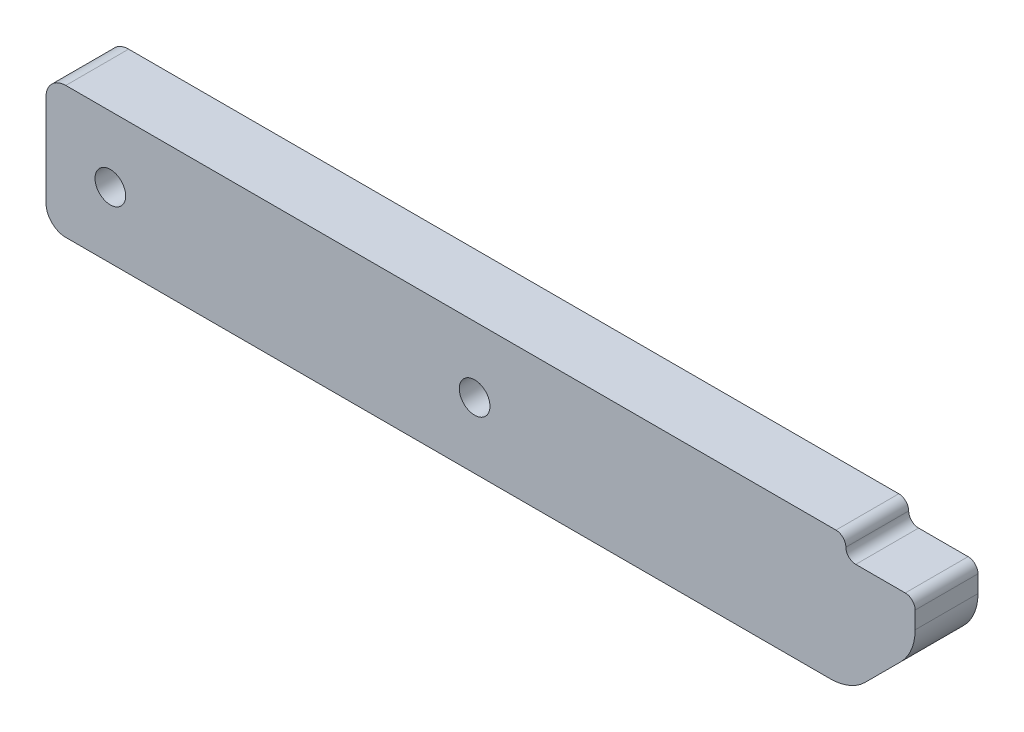
ISO-10303-21;
HEADER;
FILE_DESCRIPTION(('STEP AP214'),'2;1');
FILE_NAME('part.step','',(''),(''),'','','');
FILE_SCHEMA(('AUTOMOTIVE_DESIGN { 1 0 10303 214 1 1 1 1 }'));
ENDSEC;
DATA;
#1=APPLICATION_CONTEXT('core data for automotive mechanical design processes');
#2=APPLICATION_PROTOCOL_DEFINITION('international standard','automotive_design',2000,#1);
#3=PRODUCT_CONTEXT('',#1,'mechanical');
#4=PRODUCT('Part','Part','',(#3));
#5=PRODUCT_RELATED_PRODUCT_CATEGORY('part','',(#4));
#6=PRODUCT_DEFINITION_FORMATION('','',#4);
#7=PRODUCT_DEFINITION_CONTEXT('part definition',#1,'design');
#8=PRODUCT_DEFINITION('design','',#6,#7);
#9=PRODUCT_DEFINITION_SHAPE('','',#8);
#10=(LENGTH_UNIT() NAMED_UNIT(*) SI_UNIT(.MILLI.,.METRE.));
#11=(NAMED_UNIT(*) PLANE_ANGLE_UNIT() SI_UNIT($,.RADIAN.));
#12=(NAMED_UNIT(*) SI_UNIT($,.STERADIAN.) SOLID_ANGLE_UNIT());
#13=UNCERTAINTY_MEASURE_WITH_UNIT(LENGTH_MEASURE(1.E-05),#10,'distance_accuracy_value','');
#14=(GEOMETRIC_REPRESENTATION_CONTEXT(3) GLOBAL_UNCERTAINTY_ASSIGNED_CONTEXT((#13)) GLOBAL_UNIT_ASSIGNED_CONTEXT((#10,
#11,#12)) REPRESENTATION_CONTEXT('',''));
#15=CARTESIAN_POINT('',(0.,0.,0.));
#16=DIRECTION('',(0.,0.,1.));
#17=DIRECTION('',(1.,0.,0.));
#18=AXIS2_PLACEMENT_3D('',#15,#16,#17);
#19=CARTESIAN_POINT('',(0.,6.65000000000001,6.35));
#20=DIRECTION('',(0.,-1.,0.));
#21=DIRECTION('',(1.,0.,0.));
#22=AXIS2_PLACEMENT_3D('',#19,#20,#21);
#23=PLANE('',#22);
#24=DIRECTION('',(-1.,0.,0.));
#25=VECTOR('',#24,1.);
#26=CARTESIAN_POINT('',(0.,6.65000000000001,6.35));
#27=LINE('',#26,#25);
#28=CARTESIAN_POINT('',(28.,6.65000000000001,6.35));
#29=VERTEX_POINT('',#28);
#30=CARTESIAN_POINT('',(-49.8,6.65,6.35));
#31=VERTEX_POINT('',#30);
#32=EDGE_CURVE('E281',#29,#31,#27,.T.);
#33=ORIENTED_EDGE('',*,*,#32,.F.);
#34=DIRECTION('',(0.,0.,1.));
#35=VECTOR('',#34,1.);
#36=CARTESIAN_POINT('',(28.,6.65000000000001,6.35));
#37=LINE('',#36,#35);
#38=CARTESIAN_POINT('',(28.,6.65000000000001,0.));
#39=VERTEX_POINT('',#38);
#40=EDGE_CURVE('E147',#29,#39,#37,.F.);
#41=ORIENTED_EDGE('',*,*,#40,.T.);
#42=DIRECTION('',(-1.,0.,0.));
#43=VECTOR('',#42,1.);
#44=CARTESIAN_POINT('',(0.,6.65000000000001,0.));
#45=LINE('',#44,#43);
#46=CARTESIAN_POINT('',(-49.8,6.65,0.));
#47=VERTEX_POINT('',#46);
#48=EDGE_CURVE('E140',#39,#47,#45,.T.);
#49=ORIENTED_EDGE('',*,*,#48,.T.);
#50=DIRECTION('',(0.,0.,-1.));
#51=VECTOR('',#50,1.);
#52=CARTESIAN_POINT('',(-49.8,6.65,6.35));
#53=LINE('',#52,#51);
#54=EDGE_CURVE('E144',#47,#31,#53,.F.);
#55=ORIENTED_EDGE('',*,*,#54,.T.);
#56=EDGE_LOOP('',(#33,#41,#49,#55));
#57=FACE_BOUND('',#56,.T.);
#58=ADVANCED_FACE('F40',(#57),#23,.F.);
#59=CARTESIAN_POINT('',(-51.8,0.,6.35));
#60=DIRECTION('',(1.,0.,0.));
#61=DIRECTION('',(0.,0.,-1.));
#62=AXIS2_PLACEMENT_3D('',#59,#60,#61);
#63=PLANE('',#62);
#64=DIRECTION('',(0.,-1.,0.));
#65=VECTOR('',#64,1.);
#66=CARTESIAN_POINT('',(-51.8,0.,0.));
#67=LINE('',#66,#65);
#68=CARTESIAN_POINT('',(-51.8,4.65,0.));
#69=VERTEX_POINT('',#68);
#70=CARTESIAN_POINT('',(-51.8,-4.65,0.));
#71=VERTEX_POINT('',#70);
#72=EDGE_CURVE('E149',#69,#71,#67,.T.);
#73=ORIENTED_EDGE('',*,*,#72,.T.);
#74=DIRECTION('',(0.,0.,-1.));
#75=VECTOR('',#74,1.);
#76=CARTESIAN_POINT('',(-51.8,-4.65,6.35));
#77=LINE('',#76,#75);
#78=CARTESIAN_POINT('',(-51.8,-4.65,6.35));
#79=VERTEX_POINT('',#78);
#80=EDGE_CURVE('E191',#71,#79,#77,.F.);
#81=ORIENTED_EDGE('',*,*,#80,.T.);
#82=DIRECTION('',(0.,-1.,0.));
#83=VECTOR('',#82,1.);
#84=CARTESIAN_POINT('',(-51.8,0.,6.35));
#85=LINE('',#84,#83);
#86=CARTESIAN_POINT('',(-51.8,4.65,6.35));
#87=VERTEX_POINT('',#86);
#88=EDGE_CURVE('E284',#87,#79,#85,.T.);
#89=ORIENTED_EDGE('',*,*,#88,.F.);
#90=DIRECTION('',(0.,0.,-1.));
#91=VECTOR('',#90,1.);
#92=CARTESIAN_POINT('',(-51.8,4.65,6.35));
#93=LINE('',#92,#91);
#94=EDGE_CURVE('E188',#87,#69,#93,.T.);
#95=ORIENTED_EDGE('',*,*,#94,.T.);
#96=EDGE_LOOP('',(#73,#81,#89,#95));
#97=FACE_BOUND('',#96,.T.);
#98=ADVANCED_FACE('F323',(#97),#63,.F.);
#99=CARTESIAN_POINT('',(0.,-6.64999999999999,6.35));
#100=DIRECTION('',(0.,-1.,0.));
#101=DIRECTION('',(1.,0.,0.));
#102=AXIS2_PLACEMENT_3D('',#99,#100,#101);
#103=PLANE('',#102);
#104=DIRECTION('',(-1.,0.,0.));
#105=VECTOR('',#104,1.);
#106=CARTESIAN_POINT('',(0.,-6.64999999999999,0.));
#107=LINE('',#106,#105);
#108=CARTESIAN_POINT('',(27.4289321881345,-6.64999999999999,0.));
#109=VERTEX_POINT('',#108);
#110=CARTESIAN_POINT('',(-49.8,-6.65,0.));
#111=VERTEX_POINT('',#110);
#112=EDGE_CURVE('E296',#109,#111,#107,.T.);
#113=ORIENTED_EDGE('',*,*,#112,.F.);
#114=DIRECTION('',(0.,0.,1.));
#115=VECTOR('',#114,1.);
#116=CARTESIAN_POINT('',(27.4289321881345,-6.64999999999999,6.35));
#117=LINE('',#116,#115);
#118=CARTESIAN_POINT('',(27.4289321881345,-6.64999999999999,6.35));
#119=VERTEX_POINT('',#118);
#120=EDGE_CURVE('E202',#109,#119,#117,.T.);
#121=ORIENTED_EDGE('',*,*,#120,.T.);
#122=DIRECTION('',(-1.,0.,0.));
#123=VECTOR('',#122,1.);
#124=CARTESIAN_POINT('',(0.,-6.64999999999999,6.35));
#125=LINE('',#124,#123);
#126=CARTESIAN_POINT('',(-49.8,-6.65,6.35));
#127=VERTEX_POINT('',#126);
#128=EDGE_CURVE('E288',#119,#127,#125,.T.);
#129=ORIENTED_EDGE('',*,*,#128,.T.);
#130=DIRECTION('',(0.,0.,-1.));
#131=VECTOR('',#130,1.);
#132=CARTESIAN_POINT('',(-49.8,-6.65,0.));
#133=LINE('',#132,#131);
#134=EDGE_CURVE('E184',#127,#111,#133,.T.);
#135=ORIENTED_EDGE('',*,*,#134,.T.);
#136=EDGE_LOOP('',(#113,#121,#129,#135));
#137=FACE_BOUND('',#136,.T.);
#138=ADVANCED_FACE('F330',(#137),#103,.T.);
#139=CARTESIAN_POINT('',(36.,0.,6.35));
#140=DIRECTION('',(-1.,0.,0.));
#141=DIRECTION('',(0.,0.,1.));
#142=AXIS2_PLACEMENT_3D('',#139,#140,#141);
#143=PLANE('',#142);
#144=DIRECTION('',(0.,1.,0.));
#145=VECTOR('',#144,1.);
#146=CARTESIAN_POINT('',(36.,0.,0.));
#147=LINE('',#146,#145);
#148=CARTESIAN_POINT('',(36.,1.92106781186547,0.));
#149=VERTEX_POINT('',#148);
#150=CARTESIAN_POINT('',(36.,3.65000000000001,0.));
#151=VERTEX_POINT('',#150);
#152=EDGE_CURVE('E298',#149,#151,#147,.T.);
#153=ORIENTED_EDGE('',*,*,#152,.T.);
#154=DIRECTION('',(0.,0.,1.));
#155=VECTOR('',#154,1.);
#156=CARTESIAN_POINT('',(36.,3.65000000000001,6.35));
#157=LINE('',#156,#155);
#158=CARTESIAN_POINT('',(36.,3.65000000000001,6.35));
#159=VERTEX_POINT('',#158);
#160=EDGE_CURVE('E246',#151,#159,#157,.T.);
#161=ORIENTED_EDGE('',*,*,#160,.T.);
#162=DIRECTION('',(0.,1.,0.));
#163=VECTOR('',#162,1.);
#164=CARTESIAN_POINT('',(36.,0.,6.35));
#165=LINE('',#164,#163);
#166=CARTESIAN_POINT('',(36.,1.92106781186547,6.35));
#167=VERTEX_POINT('',#166);
#168=EDGE_CURVE('E170',#167,#159,#165,.T.);
#169=ORIENTED_EDGE('',*,*,#168,.F.);
#170=DIRECTION('',(0.,0.,-1.));
#171=VECTOR('',#170,1.);
#172=CARTESIAN_POINT('',(36.,1.92106781186547,0.));
#173=LINE('',#172,#171);
#174=EDGE_CURVE('E224',#167,#149,#173,.T.);
#175=ORIENTED_EDGE('',*,*,#174,.T.);
#176=EDGE_LOOP('',(#153,#161,#169,#175));
#177=FACE_BOUND('',#176,.T.);
#178=ADVANCED_FACE('F317',(#177),#143,.F.);
#179=CARTESIAN_POINT('',(-45.3,0.,6.35));
#180=DIRECTION('',(0.,0.,-1.));
#181=DIRECTION('',(-1.,0.,0.));
#182=AXIS2_PLACEMENT_3D('',#179,#180,#181);
#183=CYLINDRICAL_SURFACE('',#182,1.55);
#184=CARTESIAN_POINT('',(-45.3,0.,6.35));
#185=DIRECTION('',(0.,0.,1.));
#186=DIRECTION('',(1.,0.,0.));
#187=AXIS2_PLACEMENT_3D('',#184,#185,#186);
#188=CIRCLE('',#187,1.55);
#189=CARTESIAN_POINT('',(-43.75,0.,6.35));
#190=VERTEX_POINT('',#189);
#191=EDGE_CURVE('E277',#190,#190,#188,.T.);
#192=ORIENTED_EDGE('',*,*,#191,.T.);
#193=EDGE_LOOP('',(#192));
#194=FACE_BOUND('',#193,.T.);
#195=CARTESIAN_POINT('',(-45.3,0.,0.));
#196=DIRECTION('',(0.,0.,1.));
#197=DIRECTION('',(1.,0.,0.));
#198=AXIS2_PLACEMENT_3D('',#195,#196,#197);
#199=CIRCLE('',#198,1.55);
#200=CARTESIAN_POINT('',(-43.75,0.,0.));
#201=VERTEX_POINT('',#200);
#202=EDGE_CURVE('E150',#201,#201,#199,.T.);
#203=ORIENTED_EDGE('',*,*,#202,.F.);
#204=EDGE_LOOP('',(#203));
#205=FACE_BOUND('',#204,.T.);
#206=ADVANCED_FACE('F308',(#194,#205),#183,.F.);
#207=CARTESIAN_POINT('',(-8.5,0.,6.35));
#208=DIRECTION('',(0.,0.,-1.));
#209=DIRECTION('',(-1.,0.,0.));
#210=AXIS2_PLACEMENT_3D('',#207,#208,#209);
#211=CYLINDRICAL_SURFACE('',#210,1.55);
#212=CARTESIAN_POINT('',(-8.5,0.,6.35));
#213=DIRECTION('',(0.,0.,1.));
#214=DIRECTION('',(1.,0.,0.));
#215=AXIS2_PLACEMENT_3D('',#212,#213,#214);
#216=CIRCLE('',#215,1.55);
#217=CARTESIAN_POINT('',(-6.95,0.,6.35));
#218=VERTEX_POINT('',#217);
#219=EDGE_CURVE('E166',#218,#218,#216,.T.);
#220=ORIENTED_EDGE('',*,*,#219,.T.);
#221=EDGE_LOOP('',(#220));
#222=FACE_BOUND('',#221,.T.);
#223=CARTESIAN_POINT('',(-8.5,0.,0.));
#224=DIRECTION('',(0.,0.,1.));
#225=DIRECTION('',(1.,0.,0.));
#226=AXIS2_PLACEMENT_3D('',#223,#224,#225);
#227=CIRCLE('',#226,1.55);
#228=CARTESIAN_POINT('',(-6.95,0.,0.));
#229=VERTEX_POINT('',#228);
#230=EDGE_CURVE('E173',#229,#229,#227,.T.);
#231=ORIENTED_EDGE('',*,*,#230,.F.);
#232=EDGE_LOOP('',(#231));
#233=FACE_BOUND('',#232,.T.);
#234=ADVANCED_FACE('F306',(#222,#233),#211,.F.);
#235=CARTESIAN_POINT('',(0.,0.,6.35));
#236=DIRECTION('',(0.,0.,1.));
#237=DIRECTION('',(1.,0.,0.));
#238=AXIS2_PLACEMENT_3D('',#235,#236,#237);
#239=PLANE('',#238);
#240=DIRECTION('',(1.,0.,0.));
#241=VECTOR('',#240,1.);
#242=CARTESIAN_POINT('',(36.,4.65000000000001,6.35));
#243=LINE('',#242,#241);
#244=CARTESIAN_POINT('',(30.,4.65000000000001,6.35));
#245=VERTEX_POINT('',#244);
#246=CARTESIAN_POINT('',(35.,4.65000000000001,6.35));
#247=VERTEX_POINT('',#246);
#248=EDGE_CURVE('E258',#245,#247,#243,.T.);
#249=ORIENTED_EDGE('',*,*,#248,.F.);
#250=CARTESIAN_POINT('',(30.,5.65000000000001,6.35));
#251=DIRECTION('',(0.,0.,1.));
#252=DIRECTION('',(1.,0.,0.));
#253=AXIS2_PLACEMENT_3D('',#250,#251,#252);
#254=CIRCLE('',#253,1.);
#255=CARTESIAN_POINT('',(29.,5.65000000000001,6.35));
#256=VERTEX_POINT('',#255);
#257=EDGE_CURVE('E50',#245,#256,#254,.F.);
#258=ORIENTED_EDGE('',*,*,#257,.T.);
#259=CARTESIAN_POINT('',(28.,5.65000000000001,6.35));
#260=DIRECTION('',(0.,0.,1.));
#261=DIRECTION('',(1.,0.,0.));
#262=AXIS2_PLACEMENT_3D('',#259,#260,#261);
#263=CIRCLE('',#262,1.);
#264=EDGE_CURVE('E231',#256,#29,#263,.T.);
#265=ORIENTED_EDGE('',*,*,#264,.T.);
#266=ORIENTED_EDGE('',*,*,#32,.T.);
#267=CARTESIAN_POINT('',(-49.8,4.65,6.35));
#268=DIRECTION('',(0.,0.,1.));
#269=DIRECTION('',(1.,0.,0.));
#270=AXIS2_PLACEMENT_3D('',#267,#268,#269);
#271=CIRCLE('',#270,2.);
#272=EDGE_CURVE('E164',#31,#87,#271,.T.);
#273=ORIENTED_EDGE('',*,*,#272,.T.);
#274=ORIENTED_EDGE('',*,*,#88,.T.);
#275=CARTESIAN_POINT('',(-49.8,-4.65,6.35));
#276=DIRECTION('',(0.,0.,1.));
#277=DIRECTION('',(1.,0.,0.));
#278=AXIS2_PLACEMENT_3D('',#275,#276,#277);
#279=CIRCLE('',#278,2.);
#280=EDGE_CURVE('E180',#79,#127,#279,.T.);
#281=ORIENTED_EDGE('',*,*,#280,.T.);
#282=ORIENTED_EDGE('',*,*,#128,.F.);
#283=CARTESIAN_POINT('',(27.4289321881345,-1.64999999999999,6.35));
#284=DIRECTION('',(0.,0.,1.));
#285=DIRECTION('',(1.,0.,0.));
#286=AXIS2_PLACEMENT_3D('',#283,#284,#285);
#287=CIRCLE('',#286,5.);
#288=CARTESIAN_POINT('',(30.9644660940672,-5.18553390593273,6.35));
#289=VERTEX_POINT('',#288);
#290=EDGE_CURVE('E209',#119,#289,#287,.T.);
#291=ORIENTED_EDGE('',*,*,#290,.T.);
#292=DIRECTION('',(0.707106781186549,0.707106781186546,0.));
#293=VECTOR('',#292,1.);
#294=CARTESIAN_POINT('',(18.0749999999999,-18.075,6.35));
#295=LINE('',#294,#293);
#296=CARTESIAN_POINT('',(34.5355339059327,-1.61446609406727,6.35));
#297=VERTEX_POINT('',#296);
#298=EDGE_CURVE('E198',#289,#297,#295,.T.);
#299=ORIENTED_EDGE('',*,*,#298,.T.);
#300=CARTESIAN_POINT('',(31.,1.92106781186547,6.35));
#301=DIRECTION('',(0.,0.,1.));
#302=DIRECTION('',(1.,0.,0.));
#303=AXIS2_PLACEMENT_3D('',#300,#301,#302);
#304=CIRCLE('',#303,5.);
#305=EDGE_CURVE('E206',#297,#167,#304,.T.);
#306=ORIENTED_EDGE('',*,*,#305,.T.);
#307=ORIENTED_EDGE('',*,*,#168,.T.);
#308=CARTESIAN_POINT('',(35.,3.65000000000001,6.35));
#309=DIRECTION('',(0.,0.,1.));
#310=DIRECTION('',(1.,0.,0.));
#311=AXIS2_PLACEMENT_3D('',#308,#309,#310);
#312=CIRCLE('',#311,1.);
#313=EDGE_CURVE('E228',#159,#247,#312,.T.);
#314=ORIENTED_EDGE('',*,*,#313,.T.);
#315=EDGE_LOOP('',(#249,#258,#265,#266,#273,#274,#281,#282,#291,#299,#306,#307,#314));
#316=FACE_BOUND('',#315,.T.);
#317=ORIENTED_EDGE('',*,*,#191,.F.);
#318=EDGE_LOOP('',(#317));
#319=FACE_BOUND('',#318,.T.);
#320=ORIENTED_EDGE('',*,*,#219,.F.);
#321=EDGE_LOOP('',(#320));
#322=FACE_BOUND('',#321,.T.);
#323=ADVANCED_FACE('F255',(#316,#319,#322),#239,.T.);
#324=CARTESIAN_POINT('',(0.,0.,0.));
#325=DIRECTION('',(0.,0.,1.));
#326=DIRECTION('',(1.,0.,0.));
#327=AXIS2_PLACEMENT_3D('',#324,#325,#326);
#328=PLANE('',#327);
#329=ORIENTED_EDGE('',*,*,#202,.T.);
#330=EDGE_LOOP('',(#329));
#331=FACE_BOUND('',#330,.T.);
#332=ORIENTED_EDGE('',*,*,#48,.F.);
#333=CARTESIAN_POINT('',(28.,5.65000000000001,0.));
#334=DIRECTION('',(0.,0.,1.));
#335=DIRECTION('',(1.,0.,0.));
#336=AXIS2_PLACEMENT_3D('',#333,#334,#335);
#337=CIRCLE('',#336,1.);
#338=CARTESIAN_POINT('',(29.,5.65000000000001,0.));
#339=VERTEX_POINT('',#338);
#340=EDGE_CURVE('E238',#39,#339,#337,.F.);
#341=ORIENTED_EDGE('',*,*,#340,.T.);
#342=CARTESIAN_POINT('',(30.,5.65000000000001,0.));
#343=DIRECTION('',(0.,0.,1.));
#344=DIRECTION('',(1.,0.,0.));
#345=AXIS2_PLACEMENT_3D('',#342,#343,#344);
#346=CIRCLE('',#345,1.);
#347=CARTESIAN_POINT('',(30.,4.65000000000001,0.));
#348=VERTEX_POINT('',#347);
#349=EDGE_CURVE('E11',#339,#348,#346,.T.);
#350=ORIENTED_EDGE('',*,*,#349,.T.);
#351=DIRECTION('',(1.,0.,0.));
#352=VECTOR('',#351,1.);
#353=CARTESIAN_POINT('',(36.,4.65000000000001,0.));
#354=LINE('',#353,#352);
#355=CARTESIAN_POINT('',(35.,4.65000000000001,0.));
#356=VERTEX_POINT('',#355);
#357=EDGE_CURVE('E267',#348,#356,#354,.T.);
#358=ORIENTED_EDGE('',*,*,#357,.T.);
#359=CARTESIAN_POINT('',(35.,3.65000000000001,0.));
#360=DIRECTION('',(0.,0.,1.));
#361=DIRECTION('',(1.,0.,0.));
#362=AXIS2_PLACEMENT_3D('',#359,#360,#361);
#363=CIRCLE('',#362,1.);
#364=EDGE_CURVE('E57',#356,#151,#363,.F.);
#365=ORIENTED_EDGE('',*,*,#364,.T.);
#366=ORIENTED_EDGE('',*,*,#152,.F.);
#367=CARTESIAN_POINT('',(31.,1.92106781186547,0.));
#368=DIRECTION('',(0.,0.,1.));
#369=DIRECTION('',(1.,0.,0.));
#370=AXIS2_PLACEMENT_3D('',#367,#368,#369);
#371=CIRCLE('',#370,5.);
#372=CARTESIAN_POINT('',(34.5355339059327,-1.61446609406727,0.));
#373=VERTEX_POINT('',#372);
#374=EDGE_CURVE('E218',#149,#373,#371,.F.);
#375=ORIENTED_EDGE('',*,*,#374,.T.);
#376=DIRECTION('',(-0.707106781186549,-0.707106781186546,0.));
#377=VECTOR('',#376,1.);
#378=CARTESIAN_POINT('',(36.,-0.150000000000013,0.));
#379=LINE('',#378,#377);
#380=CARTESIAN_POINT('',(30.9644660940672,-5.18553390593274,0.));
#381=VERTEX_POINT('',#380);
#382=EDGE_CURVE('E194',#373,#381,#379,.T.);
#383=ORIENTED_EDGE('',*,*,#382,.T.);
#384=CARTESIAN_POINT('',(27.4289321881345,-1.64999999999999,0.));
#385=DIRECTION('',(0.,0.,1.));
#386=DIRECTION('',(1.,0.,0.));
#387=AXIS2_PLACEMENT_3D('',#384,#385,#386);
#388=CIRCLE('',#387,5.);
#389=EDGE_CURVE('E221',#381,#109,#388,.F.);
#390=ORIENTED_EDGE('',*,*,#389,.T.);
#391=ORIENTED_EDGE('',*,*,#112,.T.);
#392=CARTESIAN_POINT('',(-49.8,-4.65,0.));
#393=DIRECTION('',(0.,0.,1.));
#394=DIRECTION('',(1.,0.,0.));
#395=AXIS2_PLACEMENT_3D('',#392,#393,#394);
#396=CIRCLE('',#395,2.);
#397=EDGE_CURVE('E161',#111,#71,#396,.F.);
#398=ORIENTED_EDGE('',*,*,#397,.T.);
#399=ORIENTED_EDGE('',*,*,#72,.F.);
#400=CARTESIAN_POINT('',(-49.8,4.65,0.));
#401=DIRECTION('',(0.,0.,1.));
#402=DIRECTION('',(1.,0.,0.));
#403=AXIS2_PLACEMENT_3D('',#400,#401,#402);
#404=CIRCLE('',#403,2.);
#405=EDGE_CURVE('E153',#69,#47,#404,.F.);
#406=ORIENTED_EDGE('',*,*,#405,.T.);
#407=EDGE_LOOP('',(#332,#341,#350,#358,#365,#366,#375,#383,#390,#391,#398,#399,#406));
#408=FACE_BOUND('',#407,.T.);
#409=ORIENTED_EDGE('',*,*,#230,.T.);
#410=EDGE_LOOP('',(#409));
#411=FACE_BOUND('',#410,.T.);
#412=ADVANCED_FACE('F154',(#331,#408,#411),#328,.F.);
#413=CARTESIAN_POINT('',(-49.8,-4.65,6.35));
#414=DIRECTION('',(0.,0.,1.));
#415=DIRECTION('',(1.,0.,0.));
#416=AXIS2_PLACEMENT_3D('',#413,#414,#415);
#417=CYLINDRICAL_SURFACE('',#416,2.);
#418=ORIENTED_EDGE('',*,*,#280,.F.);
#419=ORIENTED_EDGE('',*,*,#80,.F.);
#420=ORIENTED_EDGE('',*,*,#397,.F.);
#421=ORIENTED_EDGE('',*,*,#134,.F.);
#422=EDGE_LOOP('',(#418,#419,#420,#421));
#423=FACE_BOUND('',#422,.T.);
#424=ADVANCED_FACE('F335',(#423),#417,.T.);
#425=CARTESIAN_POINT('',(-49.8,4.65,6.35));
#426=DIRECTION('',(0.,0.,-1.));
#427=DIRECTION('',(-1.,0.,0.));
#428=AXIS2_PLACEMENT_3D('',#425,#426,#427);
#429=CYLINDRICAL_SURFACE('',#428,2.);
#430=ORIENTED_EDGE('',*,*,#272,.F.);
#431=ORIENTED_EDGE('',*,*,#54,.F.);
#432=ORIENTED_EDGE('',*,*,#405,.F.);
#433=ORIENTED_EDGE('',*,*,#94,.F.);
#434=EDGE_LOOP('',(#430,#431,#432,#433));
#435=FACE_BOUND('',#434,.T.);
#436=ADVANCED_FACE('F163',(#435),#429,.T.);
#437=CARTESIAN_POINT('',(36.,-0.150000000000013,6.35));
#438=DIRECTION('',(0.707106781186546,-0.707106781186549,0.));
#439=DIRECTION('',(0.,0.,1.));
#440=AXIS2_PLACEMENT_3D('',#437,#438,#439);
#441=PLANE('',#440);
#442=ORIENTED_EDGE('',*,*,#298,.F.);
#443=DIRECTION('',(0.,0.,1.));
#444=VECTOR('',#443,1.);
#445=CARTESIAN_POINT('',(30.9644660940672,-5.18553390593274,6.35));
#446=LINE('',#445,#444);
#447=EDGE_CURVE('E215',#289,#381,#446,.F.);
#448=ORIENTED_EDGE('',*,*,#447,.T.);
#449=ORIENTED_EDGE('',*,*,#382,.F.);
#450=DIRECTION('',(0.,0.,-1.));
#451=VECTOR('',#450,1.);
#452=CARTESIAN_POINT('',(34.5355339059327,-1.61446609406727,6.35));
#453=LINE('',#452,#451);
#454=EDGE_CURVE('E212',#373,#297,#453,.F.);
#455=ORIENTED_EDGE('',*,*,#454,.T.);
#456=EDGE_LOOP('',(#442,#448,#449,#455));
#457=FACE_BOUND('',#456,.T.);
#458=ADVANCED_FACE('F341',(#457),#441,.T.);
#459=CARTESIAN_POINT('',(27.4289321881345,-1.64999999999999,6.35));
#460=DIRECTION('',(0.,0.,1.));
#461=DIRECTION('',(1.,0.,0.));
#462=AXIS2_PLACEMENT_3D('',#459,#460,#461);
#463=CYLINDRICAL_SURFACE('',#462,5.);
#464=ORIENTED_EDGE('',*,*,#389,.F.);
#465=ORIENTED_EDGE('',*,*,#447,.F.);
#466=ORIENTED_EDGE('',*,*,#290,.F.);
#467=ORIENTED_EDGE('',*,*,#120,.F.);
#468=EDGE_LOOP('',(#464,#465,#466,#467));
#469=FACE_BOUND('',#468,.T.);
#470=ADVANCED_FACE('F344',(#469),#463,.T.);
#471=CARTESIAN_POINT('',(31.,1.92106781186547,6.35));
#472=DIRECTION('',(0.,0.,1.));
#473=DIRECTION('',(1.,0.,0.));
#474=AXIS2_PLACEMENT_3D('',#471,#472,#473);
#475=CYLINDRICAL_SURFACE('',#474,5.);
#476=ORIENTED_EDGE('',*,*,#305,.F.);
#477=ORIENTED_EDGE('',*,*,#454,.F.);
#478=ORIENTED_EDGE('',*,*,#374,.F.);
#479=ORIENTED_EDGE('',*,*,#174,.F.);
#480=EDGE_LOOP('',(#476,#477,#478,#479));
#481=FACE_BOUND('',#480,.T.);
#482=ADVANCED_FACE('F348',(#481),#475,.T.);
#483=CARTESIAN_POINT('',(36.,4.65000000000001,0.));
#484=DIRECTION('',(0.,-1.,0.));
#485=DIRECTION('',(0.,0.,-1.));
#486=AXIS2_PLACEMENT_3D('',#483,#484,#485);
#487=PLANE('',#486);
#488=ORIENTED_EDGE('',*,*,#357,.F.);
#489=DIRECTION('',(0.,0.,1.));
#490=VECTOR('',#489,1.);
#491=CARTESIAN_POINT('',(30.,4.65000000000001,6.35));
#492=LINE('',#491,#490);
#493=EDGE_CURVE('E243',#348,#245,#492,.T.);
#494=ORIENTED_EDGE('',*,*,#493,.T.);
#495=ORIENTED_EDGE('',*,*,#248,.T.);
#496=DIRECTION('',(0.,0.,1.));
#497=VECTOR('',#496,1.);
#498=CARTESIAN_POINT('',(35.,4.65000000000001,0.));
#499=LINE('',#498,#497);
#500=EDGE_CURVE('E65',#247,#356,#499,.F.);
#501=ORIENTED_EDGE('',*,*,#500,.T.);
#502=EDGE_LOOP('',(#488,#494,#495,#501));
#503=FACE_BOUND('',#502,.T.);
#504=ADVANCED_FACE('F268',(#503),#487,.F.);
#505=CARTESIAN_POINT('',(30.,5.65000000000001,0.));
#506=DIRECTION('',(0.,0.,-1.));
#507=DIRECTION('',(-1.,0.,0.));
#508=AXIS2_PLACEMENT_3D('',#505,#506,#507);
#509=CYLINDRICAL_SURFACE('',#508,1.);
#510=ORIENTED_EDGE('',*,*,#493,.F.);
#511=ORIENTED_EDGE('',*,*,#349,.F.);
#512=DIRECTION('',(0.,0.,1.));
#513=VECTOR('',#512,1.);
#514=CARTESIAN_POINT('',(29.,5.65000000000001,0.));
#515=LINE('',#514,#513);
#516=EDGE_CURVE('E44',#256,#339,#515,.F.);
#517=ORIENTED_EDGE('',*,*,#516,.F.);
#518=ORIENTED_EDGE('',*,*,#257,.F.);
#519=EDGE_LOOP('',(#510,#511,#517,#518));
#520=FACE_BOUND('',#519,.T.);
#521=ADVANCED_FACE('F263',(#520),#509,.F.);
#522=CARTESIAN_POINT('',(28.,5.65000000000001,0.));
#523=DIRECTION('',(0.,0.,1.));
#524=DIRECTION('',(1.,0.,0.));
#525=AXIS2_PLACEMENT_3D('',#522,#523,#524);
#526=CYLINDRICAL_SURFACE('',#525,1.);
#527=ORIENTED_EDGE('',*,*,#340,.F.);
#528=ORIENTED_EDGE('',*,*,#40,.F.);
#529=ORIENTED_EDGE('',*,*,#264,.F.);
#530=ORIENTED_EDGE('',*,*,#516,.T.);
#531=EDGE_LOOP('',(#527,#528,#529,#530));
#532=FACE_BOUND('',#531,.T.);
#533=ADVANCED_FACE('F266',(#532),#526,.T.);
#534=CARTESIAN_POINT('',(35.,3.65000000000001,6.35));
#535=DIRECTION('',(0.,0.,1.));
#536=DIRECTION('',(1.,0.,0.));
#537=AXIS2_PLACEMENT_3D('',#534,#535,#536);
#538=CYLINDRICAL_SURFACE('',#537,1.);
#539=ORIENTED_EDGE('',*,*,#364,.F.);
#540=ORIENTED_EDGE('',*,*,#500,.F.);
#541=ORIENTED_EDGE('',*,*,#313,.F.);
#542=ORIENTED_EDGE('',*,*,#160,.F.);
#543=EDGE_LOOP('',(#539,#540,#541,#542));
#544=FACE_BOUND('',#543,.T.);
#545=ADVANCED_FACE('F42',(#544),#538,.T.);
#546=CLOSED_SHELL('',(#58,#98,#138,#178,#206,#234,#323,#412,#424,#436,#458,#470,#482,#504,#521,
#533,#545));
#547=MANIFOLD_SOLID_BREP('B2',#546);
#548=ADVANCED_BREP_SHAPE_REPRESENTATION('',(#18,#547),#14);
#549=SHAPE_DEFINITION_REPRESENTATION(#9,#548);
ENDSEC;
END-ISO-10303-21;
